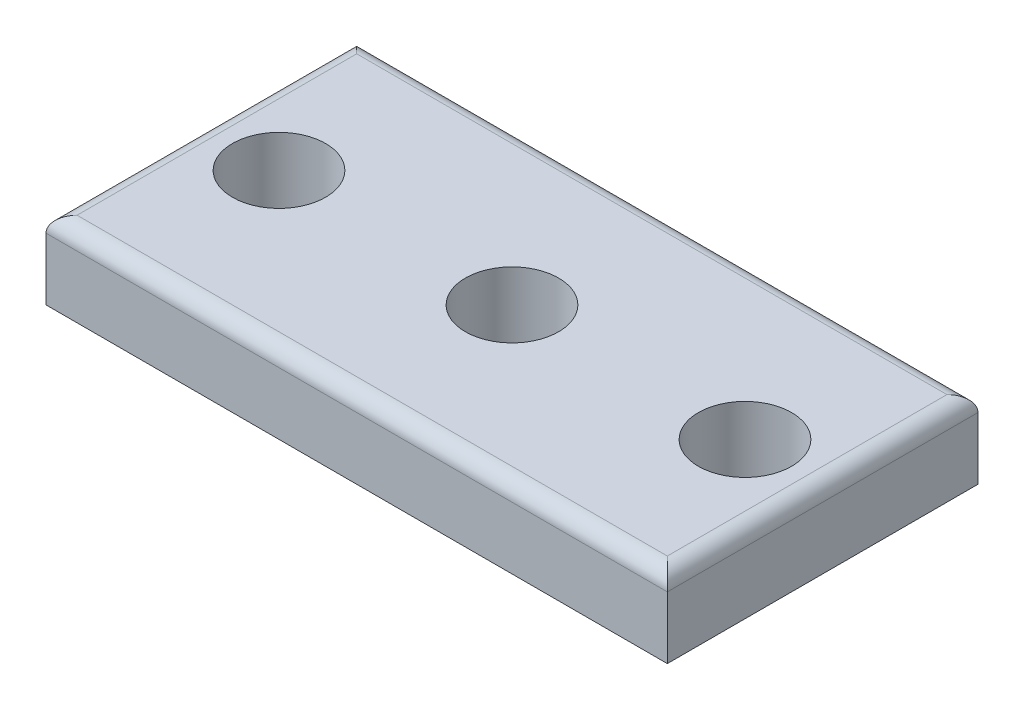
ISO-10303-21;
HEADER;
FILE_DESCRIPTION(('STEP AP214'),'2;1');
FILE_NAME('part.step','',(''),(''),'','','');
FILE_SCHEMA(('AUTOMOTIVE_DESIGN { 1 0 10303 214 1 1 1 1 }'));
ENDSEC;
DATA;
#1=APPLICATION_CONTEXT('core data for automotive mechanical design processes');
#2=APPLICATION_PROTOCOL_DEFINITION('international standard','automotive_design',2000,#1);
#3=PRODUCT_CONTEXT('',#1,'mechanical');
#4=PRODUCT('Part','Part','',(#3));
#5=PRODUCT_RELATED_PRODUCT_CATEGORY('part','',(#4));
#6=PRODUCT_DEFINITION_FORMATION('','',#4);
#7=PRODUCT_DEFINITION_CONTEXT('part definition',#1,'design');
#8=PRODUCT_DEFINITION('design','',#6,#7);
#9=PRODUCT_DEFINITION_SHAPE('','',#8);
#10=(LENGTH_UNIT() NAMED_UNIT(*) SI_UNIT(.MILLI.,.METRE.));
#11=(NAMED_UNIT(*) PLANE_ANGLE_UNIT() SI_UNIT($,.RADIAN.));
#12=(NAMED_UNIT(*) SI_UNIT($,.STERADIAN.) SOLID_ANGLE_UNIT());
#13=UNCERTAINTY_MEASURE_WITH_UNIT(LENGTH_MEASURE(1.E-05),#10,'distance_accuracy_value','');
#14=(GEOMETRIC_REPRESENTATION_CONTEXT(3) GLOBAL_UNCERTAINTY_ASSIGNED_CONTEXT((#13)) GLOBAL_UNIT_ASSIGNED_CONTEXT((#10,
#11,#12)) REPRESENTATION_CONTEXT('',''));
#15=CARTESIAN_POINT('',(0.,0.,0.));
#16=DIRECTION('',(0.,0.,1.));
#17=DIRECTION('',(1.,0.,0.));
#18=AXIS2_PLACEMENT_3D('',#15,#16,#17);
#19=CARTESIAN_POINT('',(0.,5.,0.));
#20=DIRECTION('',(0.,-1.,0.));
#21=DIRECTION('',(0.,0.,-1.));
#22=AXIS2_PLACEMENT_3D('',#19,#20,#21);
#23=PLANE('',#22);
#24=DIRECTION('',(0.,0.,1.));
#25=VECTOR('',#24,1.);
#26=CARTESIAN_POINT('',(-19.,5.,0.));
#27=LINE('',#26,#25);
#28=CARTESIAN_POINT('',(-19.,5.,-9.));
#29=VERTEX_POINT('',#28);
#30=CARTESIAN_POINT('',(-19.,5.,9.));
#31=VERTEX_POINT('',#30);
#32=EDGE_CURVE('E146',#29,#31,#27,.T.);
#33=ORIENTED_EDGE('',*,*,#32,.T.);
#34=DIRECTION('',(1.,0.,0.));
#35=VECTOR('',#34,1.);
#36=CARTESIAN_POINT('',(0.,5.,9.));
#37=LINE('',#36,#35);
#38=CARTESIAN_POINT('',(19.,5.,9.));
#39=VERTEX_POINT('',#38);
#40=EDGE_CURVE('E150',#31,#39,#37,.T.);
#41=ORIENTED_EDGE('',*,*,#40,.T.);
#42=DIRECTION('',(0.,0.,-1.));
#43=VECTOR('',#42,1.);
#44=CARTESIAN_POINT('',(19.,5.,0.));
#45=LINE('',#44,#43);
#46=CARTESIAN_POINT('',(19.,5.,-9.));
#47=VERTEX_POINT('',#46);
#48=EDGE_CURVE('E143',#39,#47,#45,.T.);
#49=ORIENTED_EDGE('',*,*,#48,.T.);
#50=DIRECTION('',(-1.,0.,0.));
#51=VECTOR('',#50,1.);
#52=CARTESIAN_POINT('',(0.,5.,-9.));
#53=LINE('',#52,#51);
#54=EDGE_CURVE('E104',#47,#29,#53,.T.);
#55=ORIENTED_EDGE('',*,*,#54,.T.);
#56=EDGE_LOOP('',(#33,#41,#49,#55));
#57=FACE_BOUND('',#56,.T.);
#58=CARTESIAN_POINT('',(-15.,5.,0.));
#59=DIRECTION('',(0.,1.,0.));
#60=DIRECTION('',(0.,0.,1.));
#61=AXIS2_PLACEMENT_3D('',#58,#59,#60);
#62=CIRCLE('',#61,3.);
#63=CARTESIAN_POINT('',(-15.,5.,3.));
#64=VERTEX_POINT('',#63);
#65=EDGE_CURVE('E121',#64,#64,#62,.T.);
#66=ORIENTED_EDGE('',*,*,#65,.F.);
#67=EDGE_LOOP('',(#66));
#68=FACE_BOUND('',#67,.T.);
#69=CARTESIAN_POINT('',(15.,5.,0.));
#70=DIRECTION('',(0.,1.,0.));
#71=DIRECTION('',(0.,0.,1.));
#72=AXIS2_PLACEMENT_3D('',#69,#70,#71);
#73=CIRCLE('',#72,3.);
#74=CARTESIAN_POINT('',(15.,5.,3.));
#75=VERTEX_POINT('',#74);
#76=EDGE_CURVE('E188',#75,#75,#73,.T.);
#77=ORIENTED_EDGE('',*,*,#76,.F.);
#78=EDGE_LOOP('',(#77));
#79=FACE_BOUND('',#78,.T.);
#80=CARTESIAN_POINT('',(0.,5.,0.));
#81=DIRECTION('',(0.,1.,0.));
#82=DIRECTION('',(0.,0.,1.));
#83=AXIS2_PLACEMENT_3D('',#80,#81,#82);
#84=CIRCLE('',#83,3.);
#85=CARTESIAN_POINT('',(0.,5.,3.));
#86=VERTEX_POINT('',#85);
#87=EDGE_CURVE('E179',#86,#86,#84,.T.);
#88=ORIENTED_EDGE('',*,*,#87,.F.);
#89=EDGE_LOOP('',(#88));
#90=FACE_BOUND('',#89,.T.);
#91=ADVANCED_FACE('F38',(#57,#68,#79,#90),#23,.F.);
#92=CARTESIAN_POINT('',(0.,0.,0.));
#93=DIRECTION('',(0.,-1.,0.));
#94=DIRECTION('',(0.,0.,-1.));
#95=AXIS2_PLACEMENT_3D('',#92,#93,#94);
#96=PLANE('',#95);
#97=CARTESIAN_POINT('',(15.,0.,0.));
#98=DIRECTION('',(0.,1.,0.));
#99=DIRECTION('',(0.,0.,1.));
#100=AXIS2_PLACEMENT_3D('',#97,#98,#99);
#101=CIRCLE('',#100,3.);
#102=CARTESIAN_POINT('',(15.,0.,3.));
#103=VERTEX_POINT('',#102);
#104=EDGE_CURVE('E185',#103,#103,#101,.T.);
#105=ORIENTED_EDGE('',*,*,#104,.T.);
#106=EDGE_LOOP('',(#105));
#107=FACE_BOUND('',#106,.T.);
#108=DIRECTION('',(0.,0.,1.));
#109=VECTOR('',#108,1.);
#110=CARTESIAN_POINT('',(-20.,0.,10.));
#111=LINE('',#110,#109);
#112=CARTESIAN_POINT('',(-20.,0.,-10.));
#113=VERTEX_POINT('',#112);
#114=CARTESIAN_POINT('',(-20.,0.,10.));
#115=VERTEX_POINT('',#114);
#116=EDGE_CURVE('E112',#113,#115,#111,.T.);
#117=ORIENTED_EDGE('',*,*,#116,.F.);
#118=DIRECTION('',(-1.,0.,0.));
#119=VECTOR('',#118,1.);
#120=CARTESIAN_POINT('',(-20.,0.,-10.));
#121=LINE('',#120,#119);
#122=CARTESIAN_POINT('',(20.,0.,-10.));
#123=VERTEX_POINT('',#122);
#124=EDGE_CURVE('E131',#123,#113,#121,.T.);
#125=ORIENTED_EDGE('',*,*,#124,.F.);
#126=DIRECTION('',(0.,0.,-1.));
#127=VECTOR('',#126,1.);
#128=CARTESIAN_POINT('',(20.,0.,10.));
#129=LINE('',#128,#127);
#130=CARTESIAN_POINT('',(20.,0.,10.));
#131=VERTEX_POINT('',#130);
#132=EDGE_CURVE('E114',#131,#123,#129,.T.);
#133=ORIENTED_EDGE('',*,*,#132,.F.);
#134=DIRECTION('',(1.,0.,0.));
#135=VECTOR('',#134,1.);
#136=CARTESIAN_POINT('',(-20.,0.,10.));
#137=LINE('',#136,#135);
#138=EDGE_CURVE('E96',#115,#131,#137,.T.);
#139=ORIENTED_EDGE('',*,*,#138,.F.);
#140=EDGE_LOOP('',(#117,#125,#133,#139));
#141=FACE_BOUND('',#140,.T.);
#142=CARTESIAN_POINT('',(-15.,0.,0.));
#143=DIRECTION('',(0.,1.,0.));
#144=DIRECTION('',(0.,0.,1.));
#145=AXIS2_PLACEMENT_3D('',#142,#143,#144);
#146=CIRCLE('',#145,3.);
#147=CARTESIAN_POINT('',(-15.,0.,3.));
#148=VERTEX_POINT('',#147);
#149=EDGE_CURVE('E125',#148,#148,#146,.T.);
#150=ORIENTED_EDGE('',*,*,#149,.T.);
#151=EDGE_LOOP('',(#150));
#152=FACE_BOUND('',#151,.T.);
#153=CARTESIAN_POINT('',(0.,0.,0.));
#154=DIRECTION('',(0.,1.,0.));
#155=DIRECTION('',(0.,0.,1.));
#156=AXIS2_PLACEMENT_3D('',#153,#154,#155);
#157=CIRCLE('',#156,3.);
#158=CARTESIAN_POINT('',(0.,0.,3.));
#159=VERTEX_POINT('',#158);
#160=EDGE_CURVE('E173',#159,#159,#157,.T.);
#161=ORIENTED_EDGE('',*,*,#160,.T.);
#162=EDGE_LOOP('',(#161));
#163=FACE_BOUND('',#162,.T.);
#164=ADVANCED_FACE('F109',(#107,#141,#152,#163),#96,.T.);
#165=CARTESIAN_POINT('',(-20.,5.,10.));
#166=DIRECTION('',(1.,0.,0.));
#167=DIRECTION('',(0.,0.,-1.));
#168=AXIS2_PLACEMENT_3D('',#165,#166,#167);
#169=PLANE('',#168);
#170=DIRECTION('',(0.,-1.,0.));
#171=VECTOR('',#170,1.);
#172=CARTESIAN_POINT('',(-20.,5.,10.));
#173=LINE('',#172,#171);
#174=CARTESIAN_POINT('',(-20.,4.,10.));
#175=VERTEX_POINT('',#174);
#176=EDGE_CURVE('E93',#175,#115,#173,.T.);
#177=ORIENTED_EDGE('',*,*,#176,.F.);
#178=DIRECTION('',(0.,0.,1.));
#179=VECTOR('',#178,1.);
#180=CARTESIAN_POINT('',(-20.,4.,10.));
#181=LINE('',#180,#179);
#182=CARTESIAN_POINT('',(-20.,4.,-10.));
#183=VERTEX_POINT('',#182);
#184=EDGE_CURVE('E153',#175,#183,#181,.F.);
#185=ORIENTED_EDGE('',*,*,#184,.T.);
#186=DIRECTION('',(0.,-1.,0.));
#187=VECTOR('',#186,1.);
#188=CARTESIAN_POINT('',(-20.,5.,-10.));
#189=LINE('',#188,#187);
#190=EDGE_CURVE('E118',#183,#113,#189,.T.);
#191=ORIENTED_EDGE('',*,*,#190,.T.);
#192=ORIENTED_EDGE('',*,*,#116,.T.);
#193=EDGE_LOOP('',(#177,#185,#191,#192));
#194=FACE_BOUND('',#193,.T.);
#195=ADVANCED_FACE('F117',(#194),#169,.F.);
#196=CARTESIAN_POINT('',(-20.,5.,10.));
#197=DIRECTION('',(0.,0.,-1.));
#198=DIRECTION('',(-1.,0.,0.));
#199=AXIS2_PLACEMENT_3D('',#196,#197,#198);
#200=PLANE('',#199);
#201=DIRECTION('',(0.,-1.,0.));
#202=VECTOR('',#201,1.);
#203=CARTESIAN_POINT('',(20.,5.,10.));
#204=LINE('',#203,#202);
#205=CARTESIAN_POINT('',(20.,4.,10.));
#206=VERTEX_POINT('',#205);
#207=EDGE_CURVE('E105',#206,#131,#204,.T.);
#208=ORIENTED_EDGE('',*,*,#207,.F.);
#209=DIRECTION('',(1.,0.,0.));
#210=VECTOR('',#209,1.);
#211=CARTESIAN_POINT('',(-20.,4.,10.));
#212=LINE('',#211,#210);
#213=EDGE_CURVE('E48',#206,#175,#212,.F.);
#214=ORIENTED_EDGE('',*,*,#213,.T.);
#215=ORIENTED_EDGE('',*,*,#176,.T.);
#216=ORIENTED_EDGE('',*,*,#138,.T.);
#217=EDGE_LOOP('',(#208,#214,#215,#216));
#218=FACE_BOUND('',#217,.T.);
#219=ADVANCED_FACE('F95',(#218),#200,.F.);
#220=CARTESIAN_POINT('',(20.,5.,10.));
#221=DIRECTION('',(-1.,0.,0.));
#222=DIRECTION('',(0.,0.,1.));
#223=AXIS2_PLACEMENT_3D('',#220,#221,#222);
#224=PLANE('',#223);
#225=DIRECTION('',(0.,-1.,0.));
#226=VECTOR('',#225,1.);
#227=CARTESIAN_POINT('',(20.,5.,-10.));
#228=LINE('',#227,#226);
#229=CARTESIAN_POINT('',(20.,4.,-10.));
#230=VERTEX_POINT('',#229);
#231=EDGE_CURVE('E136',#230,#123,#228,.T.);
#232=ORIENTED_EDGE('',*,*,#231,.F.);
#233=DIRECTION('',(0.,0.,-1.));
#234=VECTOR('',#233,1.);
#235=CARTESIAN_POINT('',(20.,4.,10.));
#236=LINE('',#235,#234);
#237=EDGE_CURVE('E56',#230,#206,#236,.F.);
#238=ORIENTED_EDGE('',*,*,#237,.T.);
#239=ORIENTED_EDGE('',*,*,#207,.T.);
#240=ORIENTED_EDGE('',*,*,#132,.T.);
#241=EDGE_LOOP('',(#232,#238,#239,#240));
#242=FACE_BOUND('',#241,.T.);
#243=ADVANCED_FACE('F225',(#242),#224,.F.);
#244=CARTESIAN_POINT('',(-20.,5.,-10.));
#245=DIRECTION('',(0.,0.,1.));
#246=DIRECTION('',(1.,0.,0.));
#247=AXIS2_PLACEMENT_3D('',#244,#245,#246);
#248=PLANE('',#247);
#249=ORIENTED_EDGE('',*,*,#190,.F.);
#250=DIRECTION('',(-1.,0.,0.));
#251=VECTOR('',#250,1.);
#252=CARTESIAN_POINT('',(-20.,4.,-10.));
#253=LINE('',#252,#251);
#254=EDGE_CURVE('E11',#183,#230,#253,.F.);
#255=ORIENTED_EDGE('',*,*,#254,.T.);
#256=ORIENTED_EDGE('',*,*,#231,.T.);
#257=ORIENTED_EDGE('',*,*,#124,.T.);
#258=EDGE_LOOP('',(#249,#255,#256,#257));
#259=FACE_BOUND('',#258,.T.);
#260=ADVANCED_FACE('F209',(#259),#248,.F.);
#261=CARTESIAN_POINT('',(-15.,5.,0.));
#262=DIRECTION('',(0.,-1.,0.));
#263=DIRECTION('',(0.,0.,-1.));
#264=AXIS2_PLACEMENT_3D('',#261,#262,#263);
#265=CYLINDRICAL_SURFACE('',#264,3.);
#266=ORIENTED_EDGE('',*,*,#65,.T.);
#267=EDGE_LOOP('',(#266));
#268=FACE_BOUND('',#267,.T.);
#269=ORIENTED_EDGE('',*,*,#149,.F.);
#270=EDGE_LOOP('',(#269));
#271=FACE_BOUND('',#270,.T.);
#272=ADVANCED_FACE('F200',(#268,#271),#265,.F.);
#273=CARTESIAN_POINT('',(15.,5.,0.));
#274=DIRECTION('',(0.,-1.,0.));
#275=DIRECTION('',(0.,0.,-1.));
#276=AXIS2_PLACEMENT_3D('',#273,#274,#275);
#277=CYLINDRICAL_SURFACE('',#276,3.);
#278=ORIENTED_EDGE('',*,*,#76,.T.);
#279=EDGE_LOOP('',(#278));
#280=FACE_BOUND('',#279,.T.);
#281=ORIENTED_EDGE('',*,*,#104,.F.);
#282=EDGE_LOOP('',(#281));
#283=FACE_BOUND('',#282,.T.);
#284=ADVANCED_FACE('F197',(#280,#283),#277,.F.);
#285=CARTESIAN_POINT('',(0.,5.,0.));
#286=DIRECTION('',(0.,-1.,0.));
#287=DIRECTION('',(0.,0.,-1.));
#288=AXIS2_PLACEMENT_3D('',#285,#286,#287);
#289=CYLINDRICAL_SURFACE('',#288,3.);
#290=ORIENTED_EDGE('',*,*,#87,.T.);
#291=EDGE_LOOP('',(#290));
#292=FACE_BOUND('',#291,.T.);
#293=ORIENTED_EDGE('',*,*,#160,.F.);
#294=EDGE_LOOP('',(#293));
#295=FACE_BOUND('',#294,.T.);
#296=ADVANCED_FACE('F199',(#292,#295),#289,.F.);
#297=CARTESIAN_POINT('',(19.,4.,0.));
#298=DIRECTION('',(0.,0.,-1.));
#299=DIRECTION('',(-1.,0.,0.));
#300=AXIS2_PLACEMENT_3D('',#297,#298,#299);
#301=CYLINDRICAL_SURFACE('',#300,1.);
#302=CARTESIAN_POINT('',(19.,4.,9.));
#303=DIRECTION('',(0.707106781186547,0.,-0.707106781186547));
#304=DIRECTION('',(0.707106781186547,0.,0.707106781186547));
#305=AXIS2_PLACEMENT_3D('',#302,#303,#304);
#306=ELLIPSE('',#305,1.41421356237309,1.);
#307=EDGE_CURVE('E165',#206,#39,#306,.F.);
#308=ORIENTED_EDGE('',*,*,#307,.F.);
#309=ORIENTED_EDGE('',*,*,#237,.F.);
#310=CARTESIAN_POINT('',(19.,4.,-9.));
#311=DIRECTION('',(-0.707106781186547,0.,-0.707106781186547));
#312=DIRECTION('',(-0.707106781186547,0.,0.707106781186547));
#313=AXIS2_PLACEMENT_3D('',#310,#311,#312);
#314=ELLIPSE('',#313,1.41421356237309,1.);
#315=EDGE_CURVE('E42',#47,#230,#314,.T.);
#316=ORIENTED_EDGE('',*,*,#315,.F.);
#317=ORIENTED_EDGE('',*,*,#48,.F.);
#318=EDGE_LOOP('',(#308,#309,#316,#317));
#319=FACE_BOUND('',#318,.T.);
#320=ADVANCED_FACE('F40',(#319),#301,.T.);
#321=CARTESIAN_POINT('',(0.,4.,-9.));
#322=DIRECTION('',(-1.,0.,0.));
#323=DIRECTION('',(0.,0.,1.));
#324=AXIS2_PLACEMENT_3D('',#321,#322,#323);
#325=CYLINDRICAL_SURFACE('',#324,1.);
#326=ORIENTED_EDGE('',*,*,#315,.T.);
#327=ORIENTED_EDGE('',*,*,#254,.F.);
#328=CARTESIAN_POINT('',(-19.,4.,-9.));
#329=DIRECTION('',(-0.707106781186547,0.,0.707106781186547));
#330=DIRECTION('',(-0.707106781186547,0.,-0.707106781186547));
#331=AXIS2_PLACEMENT_3D('',#328,#329,#330);
#332=ELLIPSE('',#331,1.41421356237309,1.);
#333=EDGE_CURVE('E163',#29,#183,#332,.T.);
#334=ORIENTED_EDGE('',*,*,#333,.F.);
#335=ORIENTED_EDGE('',*,*,#54,.F.);
#336=EDGE_LOOP('',(#326,#327,#334,#335));
#337=FACE_BOUND('',#336,.T.);
#338=ADVANCED_FACE('F237',(#337),#325,.T.);
#339=CARTESIAN_POINT('',(0.,4.,9.));
#340=DIRECTION('',(1.,0.,0.));
#341=DIRECTION('',(0.,0.,-1.));
#342=AXIS2_PLACEMENT_3D('',#339,#340,#341);
#343=CYLINDRICAL_SURFACE('',#342,1.);
#344=ORIENTED_EDGE('',*,*,#307,.T.);
#345=ORIENTED_EDGE('',*,*,#40,.F.);
#346=CARTESIAN_POINT('',(-19.,4.,9.));
#347=DIRECTION('',(0.707106781186547,0.,0.707106781186547));
#348=DIRECTION('',(0.707106781186547,0.,-0.707106781186547));
#349=AXIS2_PLACEMENT_3D('',#346,#347,#348);
#350=ELLIPSE('',#349,1.41421356237309,1.);
#351=EDGE_CURVE('E160',#175,#31,#350,.F.);
#352=ORIENTED_EDGE('',*,*,#351,.F.);
#353=ORIENTED_EDGE('',*,*,#213,.F.);
#354=EDGE_LOOP('',(#344,#345,#352,#353));
#355=FACE_BOUND('',#354,.T.);
#356=ADVANCED_FACE('F234',(#355),#343,.T.);
#357=CARTESIAN_POINT('',(-19.,4.,0.));
#358=DIRECTION('',(0.,0.,1.));
#359=DIRECTION('',(1.,0.,0.));
#360=AXIS2_PLACEMENT_3D('',#357,#358,#359);
#361=CYLINDRICAL_SURFACE('',#360,1.);
#362=ORIENTED_EDGE('',*,*,#333,.T.);
#363=ORIENTED_EDGE('',*,*,#184,.F.);
#364=ORIENTED_EDGE('',*,*,#351,.T.);
#365=ORIENTED_EDGE('',*,*,#32,.F.);
#366=EDGE_LOOP('',(#362,#363,#364,#365));
#367=FACE_BOUND('',#366,.T.);
#368=ADVANCED_FACE('F231',(#367),#361,.T.);
#369=CLOSED_SHELL('',(#91,#164,#195,#219,#243,#260,#272,#284,#296,#320,#338,#356,#368));
#370=MANIFOLD_SOLID_BREP('B2',#369);
#371=ADVANCED_BREP_SHAPE_REPRESENTATION('',(#18,#370),#14);
#372=SHAPE_DEFINITION_REPRESENTATION(#9,#371);
ENDSEC;
END-ISO-10303-21;
